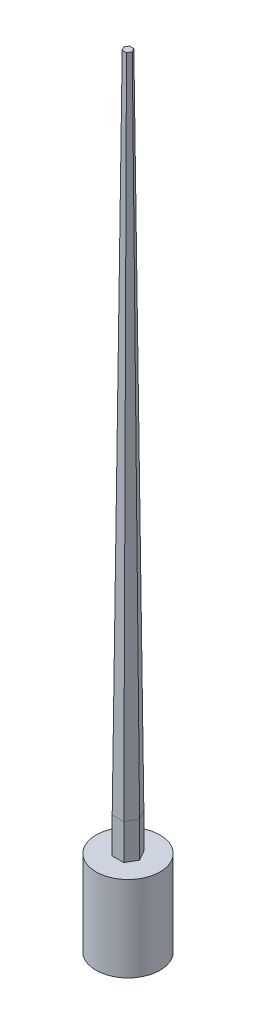
ISO-10303-21;
HEADER;
FILE_DESCRIPTION(('STEP AP214'),'2;1');
FILE_NAME('part.step','',(''),(''),'','','');
FILE_SCHEMA(('AUTOMOTIVE_DESIGN { 1 0 10303 214 1 1 1 1 }'));
ENDSEC;
DATA;
#1=APPLICATION_CONTEXT('core data for automotive mechanical design processes');
#2=APPLICATION_PROTOCOL_DEFINITION('international standard','automotive_design',2000,#1);
#3=PRODUCT_CONTEXT('',#1,'mechanical');
#4=PRODUCT('Part','Part','',(#3));
#5=PRODUCT_RELATED_PRODUCT_CATEGORY('part','',(#4));
#6=PRODUCT_DEFINITION_FORMATION('','',#4);
#7=PRODUCT_DEFINITION_CONTEXT('part definition',#1,'design');
#8=PRODUCT_DEFINITION('design','',#6,#7);
#9=PRODUCT_DEFINITION_SHAPE('','',#8);
#10=(LENGTH_UNIT() NAMED_UNIT(*) SI_UNIT(.MILLI.,.METRE.));
#11=(NAMED_UNIT(*) PLANE_ANGLE_UNIT() SI_UNIT($,.RADIAN.));
#12=(NAMED_UNIT(*) SI_UNIT($,.STERADIAN.) SOLID_ANGLE_UNIT());
#13=UNCERTAINTY_MEASURE_WITH_UNIT(LENGTH_MEASURE(1.E-05),#10,'distance_accuracy_value','');
#14=(GEOMETRIC_REPRESENTATION_CONTEXT(3) GLOBAL_UNCERTAINTY_ASSIGNED_CONTEXT((#13)) GLOBAL_UNIT_ASSIGNED_CONTEXT((#10,
#11,#12)) REPRESENTATION_CONTEXT('',''));
#15=CARTESIAN_POINT('',(0.,0.,0.));
#16=DIRECTION('',(0.,0.,1.));
#17=DIRECTION('',(1.,0.,0.));
#18=AXIS2_PLACEMENT_3D('',#15,#16,#17);
#19=CARTESIAN_POINT('',(90.9326673973666,0.,157.5));
#20=DIRECTION('',(0.865985503369206,0.00959916346240016,0.499976963484524));
#21=DIRECTION('',(0.5,0.,-0.866025403784439));
#22=AXIS2_PLACEMENT_3D('',#19,#20,#21);
#23=PLANE('',#22);
#24=DIRECTION('',(0.5,0.,-0.866025403784439));
#25=VECTOR('',#24,1.);
#26=CARTESIAN_POINT('',(76.7997132463521,1700.,149.340335116467));
#27=LINE('',#26,#25);
#28=CARTESIAN_POINT('',(163.021395926713,1700.,9.25475408708187E-13));
#29=VERTEX_POINT('',#28);
#30=CARTESIAN_POINT('',(81.5106979633569,1700.,141.180670232934));
#31=VERTEX_POINT('',#30);
#32=EDGE_CURVE('E161',#29,#31,#27,.F.);
#33=ORIENTED_EDGE('',*,*,#32,.F.);
#34=DIRECTION('',(0.0110839889989296,-0.999938570707157,0.));
#35=VECTOR('',#34,1.);
#36=CARTESIAN_POINT('',(181.865334794732,0.,9.27769270202439E-13));
#37=LINE('',#36,#35);
#38=CARTESIAN_POINT('',(59.9339656487246,11000.,8.75973167093536E-13));
#39=VERTEX_POINT('',#38);
#40=EDGE_CURVE('E43',#39,#29,#37,.T.);
#41=ORIENTED_EDGE('',*,*,#40,.F.);
#42=DIRECTION('',(-0.5,0.,0.866025403784439));
#43=VECTOR('',#42,1.);
#44=CARTESIAN_POINT('',(-0.515859462139071,11000.,104.70216840067));
#45=LINE('',#44,#43);
#46=CARTESIAN_POINT('',(29.9669828243628,11000.,51.9043368013394));
#47=VERTEX_POINT('',#46);
#48=EDGE_CURVE('E164',#47,#39,#45,.F.);
#49=ORIENTED_EDGE('',*,*,#48,.F.);
#50=DIRECTION('',(0.0055419944994648,-0.999938570707157,0.00959901604834027));
#51=VECTOR('',#50,1.);
#52=CARTESIAN_POINT('',(90.9326673973666,0.,157.5));
#53=LINE('',#52,#51);
#54=EDGE_CURVE('E168',#47,#31,#53,.T.);
#55=ORIENTED_EDGE('',*,*,#54,.T.);
#56=EDGE_LOOP('',(#33,#41,#49,#55));
#57=FACE_BOUND('',#56,.T.);
#58=ADVANCED_FACE('F34',(#57),#23,.T.);
#59=CARTESIAN_POINT('',(181.865334794732,0.,9.27769270202439E-13));
#60=DIRECTION('',(0.865985503369206,0.00959916346240016,-0.499976963484524));
#61=DIRECTION('',(-0.5,0.,-0.866025403784439));
#62=AXIS2_PLACEMENT_3D('',#59,#60,#61);
#63=PLANE('',#62);
#64=DIRECTION('',(-0.5,0.,-0.866025403784439));
#65=VECTOR('',#64,1.);
#66=CARTESIAN_POINT('',(167.732380643718,1700.,8.15966488353379));
#67=LINE('',#66,#65);
#68=CARTESIAN_POINT('',(81.5106979633558,1700.,-141.180670232934));
#69=VERTEX_POINT('',#68);
#70=EDGE_CURVE('E159',#69,#29,#67,.F.);
#71=ORIENTED_EDGE('',*,*,#70,.F.);
#72=DIRECTION('',(0.0055419944994648,-0.999938570707157,-0.00959901604834028));
#73=VECTOR('',#72,1.);
#74=CARTESIAN_POINT('',(90.9326673973655,0.,-157.5));
#75=LINE('',#74,#73);
#76=CARTESIAN_POINT('',(29.9669828243617,11000.,-51.9043368013396));
#77=VERTEX_POINT('',#76);
#78=EDGE_CURVE('E167',#77,#69,#75,.T.);
#79=ORIENTED_EDGE('',*,*,#78,.F.);
#80=DIRECTION('',(0.5,0.,0.866025403784439));
#81=VECTOR('',#80,1.);
#82=CARTESIAN_POINT('',(90.4168079352264,11000.,52.7978315993312));
#83=LINE('',#82,#81);
#84=EDGE_CURVE('E183',#39,#77,#83,.F.);
#85=ORIENTED_EDGE('',*,*,#84,.F.);
#86=ORIENTED_EDGE('',*,*,#40,.T.);
#87=EDGE_LOOP('',(#71,#79,#85,#86));
#88=FACE_BOUND('',#87,.T.);
#89=ADVANCED_FACE('F36',(#88),#63,.T.);
#90=CARTESIAN_POINT('',(90.9326673973655,0.,-157.5));
#91=DIRECTION('',(0.,0.00959916346240016,-0.999953926969049));
#92=DIRECTION('',(0.,0.999953926969049,0.00959916346240016));
#93=AXIS2_PLACEMENT_3D('',#90,#91,#92);
#94=PLANE('',#93);
#95=DIRECTION('',(-1.,0.,0.));
#96=VECTOR('',#95,1.);
#97=CARTESIAN_POINT('',(90.9326673973655,1700.,-141.180670232934));
#98=LINE('',#97,#96);
#99=CARTESIAN_POINT('',(-81.5106979633564,1700.,-141.180670232934));
#100=VERTEX_POINT('',#99);
#101=EDGE_CURVE('E113',#100,#69,#98,.F.);
#102=ORIENTED_EDGE('',*,*,#101,.F.);
#103=DIRECTION('',(-0.0055419944994648,-0.999938570707157,-0.00959901604834028));
#104=VECTOR('',#103,1.);
#105=CARTESIAN_POINT('',(-90.932667397366,0.,-157.5));
#106=LINE('',#105,#104);
#107=CARTESIAN_POINT('',(-29.9669828243623,11000.,-51.9043368013396));
#108=VERTEX_POINT('',#107);
#109=EDGE_CURVE('E177',#108,#100,#106,.T.);
#110=ORIENTED_EDGE('',*,*,#109,.F.);
#111=DIRECTION('',(1.,0.,0.));
#112=VECTOR('',#111,1.);
#113=CARTESIAN_POINT('',(90.9326673973655,11000.,-51.9043368013396));
#114=LINE('',#113,#112);
#115=EDGE_CURVE('E185',#77,#108,#114,.F.);
#116=ORIENTED_EDGE('',*,*,#115,.F.);
#117=ORIENTED_EDGE('',*,*,#78,.T.);
#118=EDGE_LOOP('',(#102,#110,#116,#117));
#119=FACE_BOUND('',#118,.T.);
#120=ADVANCED_FACE('F211',(#119),#94,.T.);
#121=CARTESIAN_POINT('',(-90.932667397366,0.,-157.5));
#122=DIRECTION('',(-0.865985503369206,0.00959916346240016,-0.499976963484525));
#123=DIRECTION('',(-0.5,0.,0.866025403784438));
#124=AXIS2_PLACEMENT_3D('',#121,#122,#123);
#125=PLANE('',#124);
#126=DIRECTION('',(-0.5,0.,0.866025403784438));
#127=VECTOR('',#126,1.);
#128=CARTESIAN_POINT('',(-76.7997132463515,1700.,-149.340335116467));
#129=LINE('',#128,#127);
#130=CARTESIAN_POINT('',(-163.021395926712,1700.,0.));
#131=VERTEX_POINT('',#130);
#132=EDGE_CURVE('E50',#131,#100,#129,.F.);
#133=ORIENTED_EDGE('',*,*,#132,.F.);
#134=DIRECTION('',(-0.0110839889989296,-0.999938570707157,0.));
#135=VECTOR('',#134,1.);
#136=CARTESIAN_POINT('',(-181.865334794732,0.,1.30314618168923E-13));
#137=LINE('',#136,#135);
#138=CARTESIAN_POINT('',(-59.9339656487247,11000.,1.46340783936163E-13));
#139=VERTEX_POINT('',#138);
#140=EDGE_CURVE('E174',#139,#131,#137,.T.);
#141=ORIENTED_EDGE('',*,*,#140,.F.);
#142=DIRECTION('',(0.5,0.,-0.866025403784438));
#143=VECTOR('',#142,1.);
#144=CARTESIAN_POINT('',(0.515859462139612,11000.,-104.70216840067));
#145=LINE('',#144,#143);
#146=EDGE_CURVE('E187',#108,#139,#145,.F.);
#147=ORIENTED_EDGE('',*,*,#146,.F.);
#148=ORIENTED_EDGE('',*,*,#109,.T.);
#149=EDGE_LOOP('',(#133,#141,#147,#148));
#150=FACE_BOUND('',#149,.T.);
#151=ADVANCED_FACE('F213',(#150),#125,.T.);
#152=CARTESIAN_POINT('',(-181.865334794732,0.,1.16436190939901E-13));
#153=DIRECTION('',(-0.865985503369206,0.00959916346240016,0.499976963484525));
#154=DIRECTION('',(0.5,0.,0.866025403784439));
#155=AXIS2_PLACEMENT_3D('',#152,#153,#154);
#156=PLANE('',#155);
#157=DIRECTION('',(0.5,0.,0.866025403784439));
#158=VECTOR('',#157,1.);
#159=CARTESIAN_POINT('',(-167.732380643718,1700.,-8.15966488353275));
#160=LINE('',#159,#158);
#161=CARTESIAN_POINT('',(-81.5106979633565,1700.,141.180670232934));
#162=VERTEX_POINT('',#161);
#163=EDGE_CURVE('E154',#162,#131,#160,.F.);
#164=ORIENTED_EDGE('',*,*,#163,.F.);
#165=DIRECTION('',(-0.00554199449946479,-0.999938570707157,0.00959901604834028));
#166=VECTOR('',#165,1.);
#167=CARTESIAN_POINT('',(-90.9326673973662,0.,157.5));
#168=LINE('',#167,#166);
#169=CARTESIAN_POINT('',(-29.9669828243625,11000.,51.9043368013395));
#170=VERTEX_POINT('',#169);
#171=EDGE_CURVE('E171',#170,#162,#168,.T.);
#172=ORIENTED_EDGE('',*,*,#171,.F.);
#173=DIRECTION('',(-0.5,0.,-0.866025403784439));
#174=VECTOR('',#173,1.);
#175=CARTESIAN_POINT('',(-90.4168079352267,11000.,-52.7978315993302));
#176=LINE('',#175,#174);
#177=EDGE_CURVE('E189',#139,#170,#176,.F.);
#178=ORIENTED_EDGE('',*,*,#177,.F.);
#179=ORIENTED_EDGE('',*,*,#140,.T.);
#180=EDGE_LOOP('',(#164,#172,#178,#179));
#181=FACE_BOUND('',#180,.T.);
#182=ADVANCED_FACE('F198',(#181),#156,.T.);
#183=CARTESIAN_POINT('',(-90.9326673973662,0.,157.5));
#184=DIRECTION('',(0.,0.00959916346240016,0.999953926969049));
#185=DIRECTION('',(0.,-0.999953926969049,0.00959916346240016));
#186=AXIS2_PLACEMENT_3D('',#183,#184,#185);
#187=PLANE('',#186);
#188=DIRECTION('',(1.,0.,0.));
#189=VECTOR('',#188,1.);
#190=CARTESIAN_POINT('',(-90.9326673973662,1700.,141.180670232934));
#191=LINE('',#190,#189);
#192=EDGE_CURVE('E11',#31,#162,#191,.F.);
#193=ORIENTED_EDGE('',*,*,#192,.F.);
#194=ORIENTED_EDGE('',*,*,#54,.F.);
#195=DIRECTION('',(-1.,0.,0.));
#196=VECTOR('',#195,1.);
#197=CARTESIAN_POINT('',(-90.9326673973663,11000.,51.9043368013396));
#198=LINE('',#197,#196);
#199=EDGE_CURVE('E58',#170,#47,#198,.F.);
#200=ORIENTED_EDGE('',*,*,#199,.F.);
#201=ORIENTED_EDGE('',*,*,#171,.T.);
#202=EDGE_LOOP('',(#193,#194,#200,#201));
#203=FACE_BOUND('',#202,.T.);
#204=ADVANCED_FACE('F201',(#203),#187,.T.);
#205=CARTESIAN_POINT('',(0.,11000.,0.));
#206=DIRECTION('',(0.,1.,0.));
#207=DIRECTION('',(0.,0.,1.));
#208=AXIS2_PLACEMENT_3D('',#205,#206,#207);
#209=PLANE('',#208);
#210=ORIENTED_EDGE('',*,*,#48,.T.);
#211=ORIENTED_EDGE('',*,*,#84,.T.);
#212=ORIENTED_EDGE('',*,*,#115,.T.);
#213=ORIENTED_EDGE('',*,*,#146,.T.);
#214=ORIENTED_EDGE('',*,*,#177,.T.);
#215=ORIENTED_EDGE('',*,*,#199,.T.);
#216=EDGE_LOOP('',(#210,#211,#212,#213,#214,#215));
#217=FACE_BOUND('',#216,.T.);
#218=ADVANCED_FACE('F193',(#217),#209,.T.);
#219=CARTESIAN_POINT('',(0.,1200.,0.));
#220=DIRECTION('',(0.,1.,0.));
#221=DIRECTION('',(0.,0.,1.));
#222=AXIS2_PLACEMENT_3D('',#219,#220,#221);
#223=PLANE('',#222);
#224=CARTESIAN_POINT('',(0.,1200.,0.));
#225=DIRECTION('',(0.,1.,0.));
#226=DIRECTION('',(0.,0.,1.));
#227=AXIS2_PLACEMENT_3D('',#224,#225,#226);
#228=CIRCLE('',#227,450.);
#229=CARTESIAN_POINT('',(0.,1200.,450.));
#230=VERTEX_POINT('',#229);
#231=EDGE_CURVE('E38',#230,#230,#228,.F.);
#232=ORIENTED_EDGE('',*,*,#231,.F.);
#233=EDGE_LOOP('',(#232));
#234=FACE_BOUND('',#233,.T.);
#235=DIRECTION('',(0.5,0.,-0.866025403784438));
#236=VECTOR('',#235,1.);
#237=CARTESIAN_POINT('',(163.021395926713,1200.,9.25475408708187E-13));
#238=LINE('',#237,#236);
#239=CARTESIAN_POINT('',(81.5106979633569,1200.,141.180670232934));
#240=VERTEX_POINT('',#239);
#241=CARTESIAN_POINT('',(163.021395926713,1200.,9.25475408708187E-13));
#242=VERTEX_POINT('',#241);
#243=EDGE_CURVE('E119',#240,#242,#238,.T.);
#244=ORIENTED_EDGE('',*,*,#243,.F.);
#245=DIRECTION('',(1.,0.,0.));
#246=VECTOR('',#245,1.);
#247=CARTESIAN_POINT('',(81.5106979633569,1200.,141.180670232934));
#248=LINE('',#247,#246);
#249=CARTESIAN_POINT('',(-81.5106979633565,1200.,141.180670232934));
#250=VERTEX_POINT('',#249);
#251=EDGE_CURVE('E139',#250,#240,#248,.T.);
#252=ORIENTED_EDGE('',*,*,#251,.F.);
#253=DIRECTION('',(0.499999999999996,0.,0.866025403784441));
#254=VECTOR('',#253,1.);
#255=CARTESIAN_POINT('',(-81.5106979633565,1200.,141.180670232934));
#256=LINE('',#255,#254);
#257=CARTESIAN_POINT('',(-163.021395926712,1200.,0.));
#258=VERTEX_POINT('',#257);
#259=EDGE_CURVE('E136',#258,#250,#256,.T.);
#260=ORIENTED_EDGE('',*,*,#259,.F.);
#261=DIRECTION('',(-0.499999999999996,0.,0.866025403784441));
#262=VECTOR('',#261,1.);
#263=CARTESIAN_POINT('',(-163.021395926712,1200.,0.));
#264=LINE('',#263,#262);
#265=CARTESIAN_POINT('',(-81.5106979633564,1200.,-141.180670232934));
#266=VERTEX_POINT('',#265);
#267=EDGE_CURVE('E129',#266,#258,#264,.T.);
#268=ORIENTED_EDGE('',*,*,#267,.F.);
#269=DIRECTION('',(-1.,0.,0.));
#270=VECTOR('',#269,1.);
#271=CARTESIAN_POINT('',(-81.5106979633564,1200.,-141.180670232934));
#272=LINE('',#271,#270);
#273=CARTESIAN_POINT('',(81.5106979633558,1200.,-141.180670232934));
#274=VERTEX_POINT('',#273);
#275=EDGE_CURVE('E111',#274,#266,#272,.T.);
#276=ORIENTED_EDGE('',*,*,#275,.F.);
#277=DIRECTION('',(-0.5,0.,-0.866025403784439));
#278=VECTOR('',#277,1.);
#279=CARTESIAN_POINT('',(81.5106979633558,1200.,-141.180670232934));
#280=LINE('',#279,#278);
#281=EDGE_CURVE('E125',#242,#274,#280,.T.);
#282=ORIENTED_EDGE('',*,*,#281,.F.);
#283=EDGE_LOOP('',(#244,#252,#260,#268,#276,#282));
#284=FACE_BOUND('',#283,.T.);
#285=ADVANCED_FACE('F124',(#234,#284),#223,.T.);
#286=CARTESIAN_POINT('',(81.5106979633558,1200.,-141.180670232934));
#287=DIRECTION('',(0.866025403784439,0.,-0.5));
#288=DIRECTION('',(-0.5,0.,-0.866025403784439));
#289=AXIS2_PLACEMENT_3D('',#286,#287,#288);
#290=PLANE('',#289);
#291=ORIENTED_EDGE('',*,*,#70,.T.);
#292=DIRECTION('',(0.,1.,0.));
#293=VECTOR('',#292,1.);
#294=CARTESIAN_POINT('',(163.021395926713,1200.,9.25475408708187E-13));
#295=LINE('',#294,#293);
#296=EDGE_CURVE('E132',#242,#29,#295,.T.);
#297=ORIENTED_EDGE('',*,*,#296,.F.);
#298=ORIENTED_EDGE('',*,*,#281,.T.);
#299=DIRECTION('',(0.,1.,0.));
#300=VECTOR('',#299,1.);
#301=CARTESIAN_POINT('',(81.5106979633558,1200.,-141.180670232934));
#302=LINE('',#301,#300);
#303=EDGE_CURVE('E108',#274,#69,#302,.T.);
#304=ORIENTED_EDGE('',*,*,#303,.T.);
#305=EDGE_LOOP('',(#291,#297,#298,#304));
#306=FACE_BOUND('',#305,.T.);
#307=ADVANCED_FACE('F131',(#306),#290,.T.);
#308=CARTESIAN_POINT('',(163.021395926713,1200.,9.25475408708187E-13));
#309=DIRECTION('',(0.866025403784439,0.,0.5));
#310=DIRECTION('',(0.5,0.,-0.866025403784438));
#311=AXIS2_PLACEMENT_3D('',#308,#309,#310);
#312=PLANE('',#311);
#313=ORIENTED_EDGE('',*,*,#32,.T.);
#314=DIRECTION('',(0.,1.,0.));
#315=VECTOR('',#314,1.);
#316=CARTESIAN_POINT('',(81.5106979633569,1200.,141.180670232934));
#317=LINE('',#316,#315);
#318=EDGE_CURVE('E144',#240,#31,#317,.T.);
#319=ORIENTED_EDGE('',*,*,#318,.F.);
#320=ORIENTED_EDGE('',*,*,#243,.T.);
#321=ORIENTED_EDGE('',*,*,#296,.T.);
#322=EDGE_LOOP('',(#313,#319,#320,#321));
#323=FACE_BOUND('',#322,.T.);
#324=ADVANCED_FACE('F246',(#323),#312,.T.);
#325=CARTESIAN_POINT('',(81.5106979633569,1200.,141.180670232934));
#326=DIRECTION('',(0.,0.,1.));
#327=DIRECTION('',(1.,0.,0.));
#328=AXIS2_PLACEMENT_3D('',#325,#326,#327);
#329=PLANE('',#328);
#330=ORIENTED_EDGE('',*,*,#192,.T.);
#331=DIRECTION('',(0.,1.,0.));
#332=VECTOR('',#331,1.);
#333=CARTESIAN_POINT('',(-81.5106979633565,1200.,141.180670232934));
#334=LINE('',#333,#332);
#335=EDGE_CURVE('E146',#250,#162,#334,.T.);
#336=ORIENTED_EDGE('',*,*,#335,.F.);
#337=ORIENTED_EDGE('',*,*,#251,.T.);
#338=ORIENTED_EDGE('',*,*,#318,.T.);
#339=EDGE_LOOP('',(#330,#336,#337,#338));
#340=FACE_BOUND('',#339,.T.);
#341=ADVANCED_FACE('F255',(#340),#329,.T.);
#342=CARTESIAN_POINT('',(-81.5106979633565,1200.,141.180670232934));
#343=DIRECTION('',(-0.866025403784441,0.,0.499999999999996));
#344=DIRECTION('',(0.499999999999996,0.,0.866025403784441));
#345=AXIS2_PLACEMENT_3D('',#342,#343,#344);
#346=PLANE('',#345);
#347=ORIENTED_EDGE('',*,*,#163,.T.);
#348=DIRECTION('',(0.,1.,0.));
#349=VECTOR('',#348,1.);
#350=CARTESIAN_POINT('',(-163.021395926712,1200.,0.));
#351=LINE('',#350,#349);
#352=EDGE_CURVE('E148',#258,#131,#351,.T.);
#353=ORIENTED_EDGE('',*,*,#352,.F.);
#354=ORIENTED_EDGE('',*,*,#259,.T.);
#355=ORIENTED_EDGE('',*,*,#335,.T.);
#356=EDGE_LOOP('',(#347,#353,#354,#355));
#357=FACE_BOUND('',#356,.T.);
#358=ADVANCED_FACE('F252',(#357),#346,.T.);
#359=CARTESIAN_POINT('',(-163.021395926712,1200.,0.));
#360=DIRECTION('',(-0.866025403784441,0.,-0.499999999999996));
#361=DIRECTION('',(-0.499999999999996,0.,0.866025403784441));
#362=AXIS2_PLACEMENT_3D('',#359,#360,#361);
#363=PLANE('',#362);
#364=ORIENTED_EDGE('',*,*,#132,.T.);
#365=DIRECTION('',(0.,1.,0.));
#366=VECTOR('',#365,1.);
#367=CARTESIAN_POINT('',(-81.5106979633564,1200.,-141.180670232934));
#368=LINE('',#367,#366);
#369=EDGE_CURVE('E118',#266,#100,#368,.T.);
#370=ORIENTED_EDGE('',*,*,#369,.F.);
#371=ORIENTED_EDGE('',*,*,#267,.T.);
#372=ORIENTED_EDGE('',*,*,#352,.T.);
#373=EDGE_LOOP('',(#364,#370,#371,#372));
#374=FACE_BOUND('',#373,.T.);
#375=ADVANCED_FACE('F249',(#374),#363,.T.);
#376=CARTESIAN_POINT('',(-81.5106979633564,1200.,-141.180670232934));
#377=DIRECTION('',(0.,0.,-1.));
#378=DIRECTION('',(-1.,0.,0.));
#379=AXIS2_PLACEMENT_3D('',#376,#377,#378);
#380=PLANE('',#379);
#381=ORIENTED_EDGE('',*,*,#101,.T.);
#382=ORIENTED_EDGE('',*,*,#303,.F.);
#383=ORIENTED_EDGE('',*,*,#275,.T.);
#384=ORIENTED_EDGE('',*,*,#369,.T.);
#385=EDGE_LOOP('',(#381,#382,#383,#384));
#386=FACE_BOUND('',#385,.T.);
#387=ADVANCED_FACE('F110',(#386),#380,.T.);
#388=CARTESIAN_POINT('',(0.,0.,0.));
#389=DIRECTION('',(0.,1.,0.));
#390=DIRECTION('',(0.,0.,1.));
#391=AXIS2_PLACEMENT_3D('',#388,#389,#390);
#392=PLANE('',#391);
#393=CARTESIAN_POINT('',(0.,0.,0.));
#394=DIRECTION('',(0.,-1.,0.));
#395=DIRECTION('',(0.,0.,-1.));
#396=AXIS2_PLACEMENT_3D('',#393,#394,#395);
#397=CIRCLE('',#396,450.);
#398=CARTESIAN_POINT('',(0.,0.,-450.));
#399=VERTEX_POINT('',#398);
#400=EDGE_CURVE('E151',#399,#399,#397,.T.);
#401=ORIENTED_EDGE('',*,*,#400,.T.);
#402=EDGE_LOOP('',(#401));
#403=FACE_BOUND('',#402,.T.);
#404=ADVANCED_FACE('F228',(#403),#392,.F.);
#405=CARTESIAN_POINT('',(0.,1700.,0.));
#406=DIRECTION('',(0.,-1.,0.));
#407=DIRECTION('',(0.,0.,-1.));
#408=AXIS2_PLACEMENT_3D('',#405,#406,#407);
#409=CYLINDRICAL_SURFACE('',#408,450.);
#410=ORIENTED_EDGE('',*,*,#400,.F.);
#411=EDGE_LOOP('',(#410));
#412=FACE_BOUND('',#411,.T.);
#413=ORIENTED_EDGE('',*,*,#231,.T.);
#414=EDGE_LOOP('',(#413));
#415=FACE_BOUND('',#414,.T.);
#416=ADVANCED_FACE('F240',(#412,#415),#409,.T.);
#417=CLOSED_SHELL('',(#58,#89,#120,#151,#182,#204,#218,#285,#307,#324,#341,#358,#375,#387,#404,#416));
#418=MANIFOLD_SOLID_BREP('B2',#417);
#419=ADVANCED_BREP_SHAPE_REPRESENTATION('',(#18,#418),#14);
#420=SHAPE_DEFINITION_REPRESENTATION(#9,#419);
ENDSEC;
END-ISO-10303-21;
